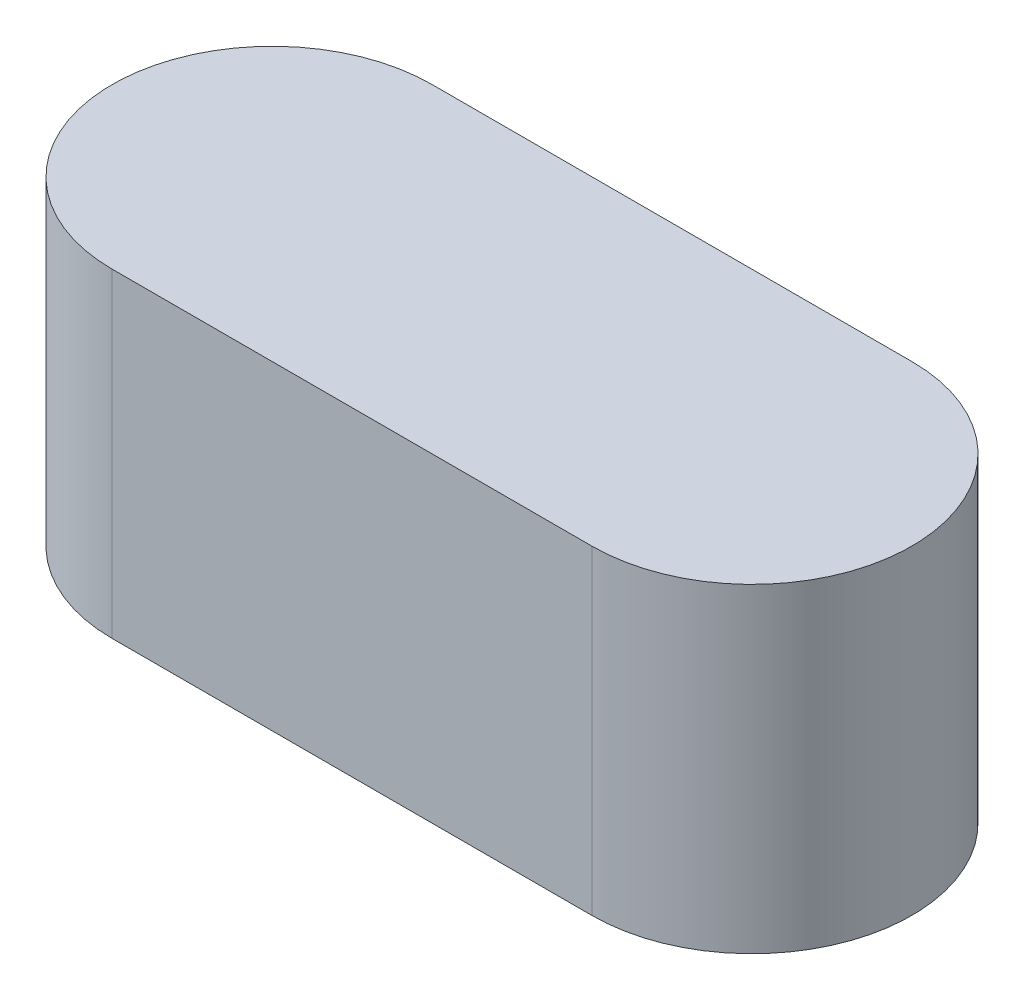
ISO-10303-21;
HEADER;
FILE_DESCRIPTION(('STEP AP214'),'2;1');
FILE_NAME('part.step','',(''),(''),'','','');
FILE_SCHEMA(('AUTOMOTIVE_DESIGN { 1 0 10303 214 1 1 1 1 }'));
ENDSEC;
DATA;
#1=APPLICATION_CONTEXT('core data for automotive mechanical design processes');
#2=APPLICATION_PROTOCOL_DEFINITION('international standard','automotive_design',2000,#1);
#3=PRODUCT_CONTEXT('',#1,'mechanical');
#4=PRODUCT('Part','Part','',(#3));
#5=PRODUCT_RELATED_PRODUCT_CATEGORY('part','',(#4));
#6=PRODUCT_DEFINITION_FORMATION('','',#4);
#7=PRODUCT_DEFINITION_CONTEXT('part definition',#1,'design');
#8=PRODUCT_DEFINITION('design','',#6,#7);
#9=PRODUCT_DEFINITION_SHAPE('','',#8);
#10=(LENGTH_UNIT() NAMED_UNIT(*) SI_UNIT(.MILLI.,.METRE.));
#11=(NAMED_UNIT(*) PLANE_ANGLE_UNIT() SI_UNIT($,.RADIAN.));
#12=(NAMED_UNIT(*) SI_UNIT($,.STERADIAN.) SOLID_ANGLE_UNIT());
#13=UNCERTAINTY_MEASURE_WITH_UNIT(LENGTH_MEASURE(1.E-05),#10,'distance_accuracy_value','');
#14=(GEOMETRIC_REPRESENTATION_CONTEXT(3) GLOBAL_UNCERTAINTY_ASSIGNED_CONTEXT((#13)) GLOBAL_UNIT_ASSIGNED_CONTEXT((#10,
#11,#12)) REPRESENTATION_CONTEXT('',''));
#15=CARTESIAN_POINT('',(0.,0.,0.));
#16=DIRECTION('',(0.,0.,1.));
#17=DIRECTION('',(1.,0.,0.));
#18=AXIS2_PLACEMENT_3D('',#15,#16,#17);
#19=CARTESIAN_POINT('',(0.,20.,0.));
#20=DIRECTION('',(0.,-1.,0.));
#21=DIRECTION('',(0.,0.,-1.));
#22=AXIS2_PLACEMENT_3D('',#19,#20,#21);
#23=CYLINDRICAL_SURFACE('',#22,10.);
#24=CARTESIAN_POINT('',(0.,20.,0.));
#25=DIRECTION('',(0.,1.,0.));
#26=DIRECTION('',(0.,0.,1.));
#27=AXIS2_PLACEMENT_3D('',#24,#25,#26);
#28=CIRCLE('',#27,10.);
#29=CARTESIAN_POINT('',(0.,20.,-10.));
#30=VERTEX_POINT('',#29);
#31=CARTESIAN_POINT('',(0.,20.,10.));
#32=VERTEX_POINT('',#31);
#33=EDGE_CURVE('E11',#30,#32,#28,.T.);
#34=ORIENTED_EDGE('',*,*,#33,.F.);
#35=DIRECTION('',(0.,1.,0.));
#36=VECTOR('',#35,1.);
#37=CARTESIAN_POINT('',(0.,0.,-10.));
#38=LINE('',#37,#36);
#39=CARTESIAN_POINT('',(0.,0.,-10.));
#40=VERTEX_POINT('',#39);
#41=EDGE_CURVE('E115',#40,#30,#38,.T.);
#42=ORIENTED_EDGE('',*,*,#41,.F.);
#43=CARTESIAN_POINT('',(0.,0.,0.));
#44=DIRECTION('',(0.,1.,0.));
#45=DIRECTION('',(0.,0.,1.));
#46=AXIS2_PLACEMENT_3D('',#43,#44,#45);
#47=CIRCLE('',#46,10.);
#48=CARTESIAN_POINT('',(0.,0.,10.));
#49=VERTEX_POINT('',#48);
#50=EDGE_CURVE('E42',#40,#49,#47,.T.);
#51=ORIENTED_EDGE('',*,*,#50,.T.);
#52=DIRECTION('',(0.,1.,0.));
#53=VECTOR('',#52,1.);
#54=CARTESIAN_POINT('',(0.,0.,10.));
#55=LINE('',#54,#53);
#56=EDGE_CURVE('E84',#49,#32,#55,.T.);
#57=ORIENTED_EDGE('',*,*,#56,.T.);
#58=EDGE_LOOP('',(#34,#42,#51,#57));
#59=FACE_BOUND('',#58,.T.);
#60=ADVANCED_FACE('F39',(#59),#23,.T.);
#61=CARTESIAN_POINT('',(0.,20.,0.));
#62=DIRECTION('',(0.,1.,0.));
#63=DIRECTION('',(0.,0.,1.));
#64=AXIS2_PLACEMENT_3D('',#61,#62,#63);
#65=PLANE('',#64);
#66=ORIENTED_EDGE('',*,*,#33,.T.);
#67=DIRECTION('',(1.,0.,0.));
#68=VECTOR('',#67,1.);
#69=CARTESIAN_POINT('',(0.,20.,10.));
#70=LINE('',#69,#68);
#71=CARTESIAN_POINT('',(30.,20.,10.));
#72=VERTEX_POINT('',#71);
#73=EDGE_CURVE('E110',#32,#72,#70,.T.);
#74=ORIENTED_EDGE('',*,*,#73,.T.);
#75=CARTESIAN_POINT('',(30.,20.,0.));
#76=DIRECTION('',(0.,1.,0.));
#77=DIRECTION('',(0.,0.,1.));
#78=AXIS2_PLACEMENT_3D('',#75,#76,#77);
#79=CIRCLE('',#78,10.);
#80=CARTESIAN_POINT('',(30.,20.,-10.));
#81=VERTEX_POINT('',#80);
#82=EDGE_CURVE('E91',#72,#81,#79,.T.);
#83=ORIENTED_EDGE('',*,*,#82,.T.);
#84=DIRECTION('',(-1.,0.,0.));
#85=VECTOR('',#84,1.);
#86=CARTESIAN_POINT('',(0.,20.,-10.));
#87=LINE('',#86,#85);
#88=EDGE_CURVE('E53',#81,#30,#87,.T.);
#89=ORIENTED_EDGE('',*,*,#88,.T.);
#90=EDGE_LOOP('',(#66,#74,#83,#89));
#91=FACE_BOUND('',#90,.T.);
#92=ADVANCED_FACE('F123',(#91),#65,.T.);
#93=CARTESIAN_POINT('',(0.,0.,0.));
#94=DIRECTION('',(0.,1.,0.));
#95=DIRECTION('',(0.,0.,1.));
#96=AXIS2_PLACEMENT_3D('',#93,#94,#95);
#97=PLANE('',#96);
#98=ORIENTED_EDGE('',*,*,#50,.F.);
#99=DIRECTION('',(-1.,0.,0.));
#100=VECTOR('',#99,1.);
#101=CARTESIAN_POINT('',(0.,0.,-10.));
#102=LINE('',#101,#100);
#103=CARTESIAN_POINT('',(30.,0.,-10.));
#104=VERTEX_POINT('',#103);
#105=EDGE_CURVE('E61',#104,#40,#102,.T.);
#106=ORIENTED_EDGE('',*,*,#105,.F.);
#107=CARTESIAN_POINT('',(30.,0.,0.));
#108=DIRECTION('',(0.,1.,0.));
#109=DIRECTION('',(0.,0.,1.));
#110=AXIS2_PLACEMENT_3D('',#107,#108,#109);
#111=CIRCLE('',#110,10.);
#112=CARTESIAN_POINT('',(30.,0.,10.));
#113=VERTEX_POINT('',#112);
#114=EDGE_CURVE('E90',#113,#104,#111,.T.);
#115=ORIENTED_EDGE('',*,*,#114,.F.);
#116=DIRECTION('',(1.,0.,0.));
#117=VECTOR('',#116,1.);
#118=CARTESIAN_POINT('',(0.,0.,10.));
#119=LINE('',#118,#117);
#120=EDGE_CURVE('E98',#49,#113,#119,.T.);
#121=ORIENTED_EDGE('',*,*,#120,.F.);
#122=EDGE_LOOP('',(#98,#106,#115,#121));
#123=FACE_BOUND('',#122,.T.);
#124=ADVANCED_FACE('F97',(#123),#97,.F.);
#125=CARTESIAN_POINT('',(0.,0.,-10.));
#126=DIRECTION('',(0.,0.,-1.));
#127=DIRECTION('',(-1.,0.,0.));
#128=AXIS2_PLACEMENT_3D('',#125,#126,#127);
#129=PLANE('',#128);
#130=ORIENTED_EDGE('',*,*,#88,.F.);
#131=DIRECTION('',(0.,1.,0.));
#132=VECTOR('',#131,1.);
#133=CARTESIAN_POINT('',(30.,0.,-10.));
#134=LINE('',#133,#132);
#135=EDGE_CURVE('E78',#104,#81,#134,.T.);
#136=ORIENTED_EDGE('',*,*,#135,.F.);
#137=ORIENTED_EDGE('',*,*,#105,.T.);
#138=ORIENTED_EDGE('',*,*,#41,.T.);
#139=EDGE_LOOP('',(#130,#136,#137,#138));
#140=FACE_BOUND('',#139,.T.);
#141=ADVANCED_FACE('F124',(#140),#129,.T.);
#142=CARTESIAN_POINT('',(30.,0.,0.));
#143=DIRECTION('',(0.,1.,0.));
#144=DIRECTION('',(0.,0.,1.));
#145=AXIS2_PLACEMENT_3D('',#142,#143,#144);
#146=CYLINDRICAL_SURFACE('',#145,10.);
#147=ORIENTED_EDGE('',*,*,#82,.F.);
#148=DIRECTION('',(0.,1.,0.));
#149=VECTOR('',#148,1.);
#150=CARTESIAN_POINT('',(30.,0.,10.));
#151=LINE('',#150,#149);
#152=EDGE_CURVE('E87',#113,#72,#151,.T.);
#153=ORIENTED_EDGE('',*,*,#152,.F.);
#154=ORIENTED_EDGE('',*,*,#114,.T.);
#155=ORIENTED_EDGE('',*,*,#135,.T.);
#156=EDGE_LOOP('',(#147,#153,#154,#155));
#157=FACE_BOUND('',#156,.T.);
#158=ADVANCED_FACE('F89',(#157),#146,.T.);
#159=CARTESIAN_POINT('',(0.,0.,10.));
#160=DIRECTION('',(0.,0.,1.));
#161=DIRECTION('',(1.,0.,0.));
#162=AXIS2_PLACEMENT_3D('',#159,#160,#161);
#163=PLANE('',#162);
#164=ORIENTED_EDGE('',*,*,#73,.F.);
#165=ORIENTED_EDGE('',*,*,#56,.F.);
#166=ORIENTED_EDGE('',*,*,#120,.T.);
#167=ORIENTED_EDGE('',*,*,#152,.T.);
#168=EDGE_LOOP('',(#164,#165,#166,#167));
#169=FACE_BOUND('',#168,.T.);
#170=ADVANCED_FACE('F102',(#169),#163,.T.);
#171=CLOSED_SHELL('',(#60,#92,#124,#141,#158,#170));
#172=MANIFOLD_SOLID_BREP('B2',#171);
#173=ADVANCED_BREP_SHAPE_REPRESENTATION('',(#18,#172),#14);
#174=SHAPE_DEFINITION_REPRESENTATION(#9,#173);
ENDSEC;
END-ISO-10303-21;
